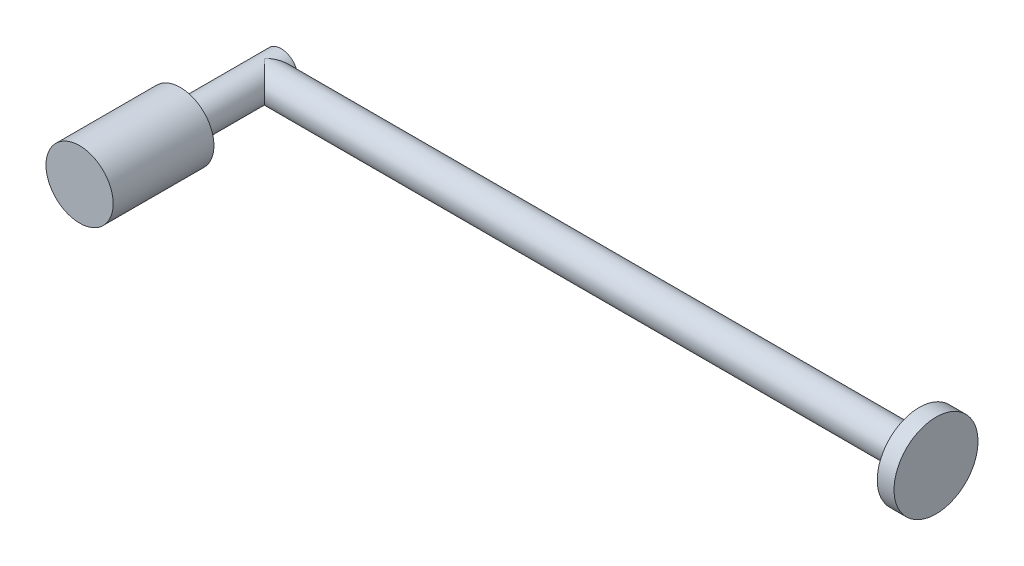
ISO-10303-21;
HEADER;
FILE_DESCRIPTION(('STEP AP214'),'2;1');
FILE_NAME('part.step','',(''),(''),'','','');
FILE_SCHEMA(('AUTOMOTIVE_DESIGN { 1 0 10303 214 1 1 1 1 }'));
ENDSEC;
DATA;
#1=APPLICATION_CONTEXT('core data for automotive mechanical design processes');
#2=APPLICATION_PROTOCOL_DEFINITION('international standard','automotive_design',2000,#1);
#3=PRODUCT_CONTEXT('',#1,'mechanical');
#4=PRODUCT('Part','Part','',(#3));
#5=PRODUCT_RELATED_PRODUCT_CATEGORY('part','',(#4));
#6=PRODUCT_DEFINITION_FORMATION('','',#4);
#7=PRODUCT_DEFINITION_CONTEXT('part definition',#1,'design');
#8=PRODUCT_DEFINITION('design','',#6,#7);
#9=PRODUCT_DEFINITION_SHAPE('','',#8);
#10=(LENGTH_UNIT() NAMED_UNIT(*) SI_UNIT(.MILLI.,.METRE.));
#11=(NAMED_UNIT(*) PLANE_ANGLE_UNIT() SI_UNIT($,.RADIAN.));
#12=(NAMED_UNIT(*) SI_UNIT($,.STERADIAN.) SOLID_ANGLE_UNIT());
#13=UNCERTAINTY_MEASURE_WITH_UNIT(LENGTH_MEASURE(1.E-05),#10,'distance_accuracy_value','');
#14=(GEOMETRIC_REPRESENTATION_CONTEXT(3) GLOBAL_UNCERTAINTY_ASSIGNED_CONTEXT((#13)) GLOBAL_UNIT_ASSIGNED_CONTEXT((#10,
#11,#12)) REPRESENTATION_CONTEXT('',''));
#15=CARTESIAN_POINT('',(0.,0.,0.));
#16=DIRECTION('',(0.,0.,1.));
#17=DIRECTION('',(1.,0.,0.));
#18=AXIS2_PLACEMENT_3D('',#15,#16,#17);
#19=CARTESIAN_POINT('',(40.,0.,-5.));
#20=DIRECTION('',(-1.,0.,0.));
#21=DIRECTION('',(0.,0.,1.));
#22=AXIS2_PLACEMENT_3D('',#19,#20,#21);
#23=CYLINDRICAL_SURFACE('',#22,1.);
#24=CARTESIAN_POINT('',(0.,0.,-5.));
#25=DIRECTION('',(-0.707106781186548,0.,-0.707106781186548));
#26=DIRECTION('',(0.707106781186548,0.,-0.707106781186548));
#27=AXIS2_PLACEMENT_3D('',#24,#25,#26);
#28=ELLIPSE('',#27,1.41421356237309,1.);
#29=CARTESIAN_POINT('',(0.,1.,-5.));
#30=VERTEX_POINT('',#29);
#31=CARTESIAN_POINT('',(1.,0.,-6.));
#32=VERTEX_POINT('',#31);
#33=EDGE_CURVE('E34',#30,#32,#28,.T.);
#34=ORIENTED_EDGE('',*,*,#33,.F.);
#35=CARTESIAN_POINT('',(0.,0.,-5.));
#36=DIRECTION('',(0.707106781186548,0.,-0.707106781186548));
#37=DIRECTION('',(-0.707106781186548,0.,-0.707106781186548));
#38=AXIS2_PLACEMENT_3D('',#35,#36,#37);
#39=ELLIPSE('',#38,1.41421356237309,1.);
#40=CARTESIAN_POINT('',(0.,-1.,-5.));
#41=VERTEX_POINT('',#40);
#42=EDGE_CURVE('E40',#41,#30,#39,.F.);
#43=ORIENTED_EDGE('',*,*,#42,.F.);
#44=EDGE_CURVE('E38',#32,#41,#28,.T.);
#45=ORIENTED_EDGE('',*,*,#44,.F.);
#46=EDGE_LOOP('',(#34,#43,#45));
#47=FACE_BOUND('',#46,.T.);
#48=CARTESIAN_POINT('',(39.,0.,-5.));
#49=DIRECTION('',(1.,0.,0.));
#50=DIRECTION('',(0.,0.,-1.));
#51=AXIS2_PLACEMENT_3D('',#48,#49,#50);
#52=CIRCLE('',#51,1.);
#53=CARTESIAN_POINT('',(39.,0.,-6.));
#54=VERTEX_POINT('',#53);
#55=EDGE_CURVE('E11',#54,#54,#52,.T.);
#56=ORIENTED_EDGE('',*,*,#55,.F.);
#57=EDGE_LOOP('',(#56));
#58=FACE_BOUND('',#57,.T.);
#59=ADVANCED_FACE('F19',(#47,#58),#23,.T.);
#60=CARTESIAN_POINT('',(0.,0.,0.));
#61=DIRECTION('',(0.,0.,-1.));
#62=DIRECTION('',(-1.,0.,0.));
#63=AXIS2_PLACEMENT_3D('',#60,#61,#62);
#64=CYLINDRICAL_SURFACE('',#63,1.);
#65=CARTESIAN_POINT('',(0.,0.,0.));
#66=DIRECTION('',(0.,0.,-1.));
#67=DIRECTION('',(-1.,0.,0.));
#68=AXIS2_PLACEMENT_3D('',#65,#66,#67);
#69=CIRCLE('',#68,1.);
#70=CARTESIAN_POINT('',(-1.,0.,0.));
#71=VERTEX_POINT('',#70);
#72=EDGE_CURVE('E54',#71,#71,#69,.T.);
#73=ORIENTED_EDGE('',*,*,#72,.T.);
#74=EDGE_LOOP('',(#73));
#75=FACE_BOUND('',#74,.T.);
#76=ORIENTED_EDGE('',*,*,#42,.T.);
#77=ORIENTED_EDGE('',*,*,#33,.T.);
#78=CARTESIAN_POINT('',(0.,0.,-6.));
#79=DIRECTION('',(0.,0.,-1.));
#80=DIRECTION('',(-1.,0.,0.));
#81=AXIS2_PLACEMENT_3D('',#78,#79,#80);
#82=CIRCLE('',#81,1.);
#83=EDGE_CURVE('E47',#32,#32,#82,.T.);
#84=ORIENTED_EDGE('',*,*,#83,.F.);
#85=ORIENTED_EDGE('',*,*,#44,.T.);
#86=EDGE_LOOP('',(#76,#77,#84,#85));
#87=FACE_BOUND('',#86,.T.);
#88=ADVANCED_FACE('F45',(#75,#87),#64,.T.);
#89=CARTESIAN_POINT('',(0.,0.,6.));
#90=DIRECTION('',(0.,0.,-1.));
#91=DIRECTION('',(-1.,0.,0.));
#92=AXIS2_PLACEMENT_3D('',#89,#90,#91);
#93=CYLINDRICAL_SURFACE('',#92,2.);
#94=CARTESIAN_POINT('',(0.,0.,6.));
#95=DIRECTION('',(0.,0.,1.));
#96=DIRECTION('',(1.,0.,0.));
#97=AXIS2_PLACEMENT_3D('',#94,#95,#96);
#98=CIRCLE('',#97,2.);
#99=CARTESIAN_POINT('',(2.,0.,6.));
#100=VERTEX_POINT('',#99);
#101=EDGE_CURVE('E27',#100,#100,#98,.T.);
#102=ORIENTED_EDGE('',*,*,#101,.F.);
#103=EDGE_LOOP('',(#102));
#104=FACE_BOUND('',#103,.T.);
#105=CARTESIAN_POINT('',(0.,0.,0.));
#106=DIRECTION('',(0.,0.,-1.));
#107=DIRECTION('',(-1.,0.,0.));
#108=AXIS2_PLACEMENT_3D('',#105,#106,#107);
#109=CIRCLE('',#108,2.);
#110=CARTESIAN_POINT('',(-2.,0.,0.));
#111=VERTEX_POINT('',#110);
#112=EDGE_CURVE('E58',#111,#111,#109,.T.);
#113=ORIENTED_EDGE('',*,*,#112,.F.);
#114=EDGE_LOOP('',(#113));
#115=FACE_BOUND('',#114,.T.);
#116=ADVANCED_FACE('F21',(#104,#115),#93,.T.);
#117=CARTESIAN_POINT('',(0.,0.,6.));
#118=DIRECTION('',(0.,0.,1.));
#119=DIRECTION('',(1.,0.,0.));
#120=AXIS2_PLACEMENT_3D('',#117,#118,#119);
#121=PLANE('',#120);
#122=ORIENTED_EDGE('',*,*,#101,.T.);
#123=EDGE_LOOP('',(#122));
#124=FACE_BOUND('',#123,.T.);
#125=ADVANCED_FACE('F68',(#124),#121,.T.);
#126=CARTESIAN_POINT('',(0.,0.,0.));
#127=DIRECTION('',(0.,0.,-1.));
#128=DIRECTION('',(-1.,0.,0.));
#129=AXIS2_PLACEMENT_3D('',#126,#127,#128);
#130=PLANE('',#129);
#131=ORIENTED_EDGE('',*,*,#72,.F.);
#132=EDGE_LOOP('',(#131));
#133=FACE_BOUND('',#132,.T.);
#134=ORIENTED_EDGE('',*,*,#112,.T.);
#135=EDGE_LOOP('',(#134));
#136=FACE_BOUND('',#135,.T.);
#137=ADVANCED_FACE('F65',(#133,#136),#130,.T.);
#138=CARTESIAN_POINT('',(0.,0.,-6.));
#139=DIRECTION('',(0.,0.,1.));
#140=DIRECTION('',(1.,0.,0.));
#141=AXIS2_PLACEMENT_3D('',#138,#139,#140);
#142=PLANE('',#141);
#143=ORIENTED_EDGE('',*,*,#83,.T.);
#144=EDGE_LOOP('',(#143));
#145=FACE_BOUND('',#144,.T.);
#146=ADVANCED_FACE('F89',(#145),#142,.F.);
#147=CARTESIAN_POINT('',(39.,0.,-5.));
#148=DIRECTION('',(1.,0.,0.));
#149=DIRECTION('',(0.,0.,-1.));
#150=AXIS2_PLACEMENT_3D('',#147,#148,#149);
#151=PLANE('',#150);
#152=CARTESIAN_POINT('',(39.,0.,-5.));
#153=DIRECTION('',(1.,0.,0.));
#154=DIRECTION('',(0.,0.,-1.));
#155=AXIS2_PLACEMENT_3D('',#152,#153,#154);
#156=CIRCLE('',#155,2.5);
#157=CARTESIAN_POINT('',(39.,0.,-7.5));
#158=VERTEX_POINT('',#157);
#159=EDGE_CURVE('E48',#158,#158,#156,.T.);
#160=ORIENTED_EDGE('',*,*,#159,.F.);
#161=EDGE_LOOP('',(#160));
#162=FACE_BOUND('',#161,.T.);
#163=ORIENTED_EDGE('',*,*,#55,.T.);
#164=EDGE_LOOP('',(#163));
#165=FACE_BOUND('',#164,.T.);
#166=ADVANCED_FACE('F92',(#162,#165),#151,.F.);
#167=CARTESIAN_POINT('',(39.,0.,-5.));
#168=DIRECTION('',(1.,0.,0.));
#169=DIRECTION('',(0.,0.,-1.));
#170=AXIS2_PLACEMENT_3D('',#167,#168,#169);
#171=CYLINDRICAL_SURFACE('',#170,2.5);
#172=ORIENTED_EDGE('',*,*,#159,.T.);
#173=EDGE_LOOP('',(#172));
#174=FACE_BOUND('',#173,.T.);
#175=CARTESIAN_POINT('',(40.,0.,-5.));
#176=DIRECTION('',(1.,0.,0.));
#177=DIRECTION('',(0.,0.,-1.));
#178=AXIS2_PLACEMENT_3D('',#175,#176,#177);
#179=CIRCLE('',#178,2.5);
#180=CARTESIAN_POINT('',(40.,0.,-7.5));
#181=VERTEX_POINT('',#180);
#182=EDGE_CURVE('E51',#181,#181,#179,.T.);
#183=ORIENTED_EDGE('',*,*,#182,.F.);
#184=EDGE_LOOP('',(#183));
#185=FACE_BOUND('',#184,.T.);
#186=ADVANCED_FACE('F96',(#174,#185),#171,.T.);
#187=CARTESIAN_POINT('',(40.,0.,-5.));
#188=DIRECTION('',(1.,0.,0.));
#189=DIRECTION('',(0.,0.,-1.));
#190=AXIS2_PLACEMENT_3D('',#187,#188,#189);
#191=PLANE('',#190);
#192=ORIENTED_EDGE('',*,*,#182,.T.);
#193=EDGE_LOOP('',(#192));
#194=FACE_BOUND('',#193,.T.);
#195=ADVANCED_FACE('F85',(#194),#191,.T.);
#196=CLOSED_SHELL('',(#59,#88,#116,#125,#137,#146,#166,#186,#195));
#197=MANIFOLD_SOLID_BREP('B1',#196);
#198=ADVANCED_BREP_SHAPE_REPRESENTATION('',(#18,#197),#14);
#199=SHAPE_DEFINITION_REPRESENTATION(#9,#198);
ENDSEC;
END-ISO-10303-21;
